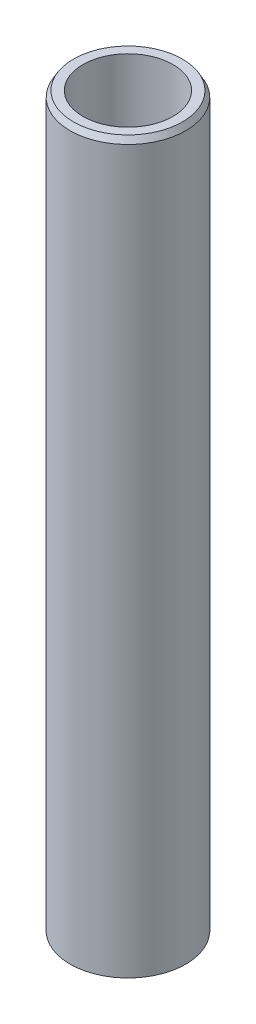
ISO-10303-21;
HEADER;
FILE_DESCRIPTION(('STEP AP214'),'2;1');
FILE_NAME('part.step','',(''),(''),'','','');
FILE_SCHEMA(('AUTOMOTIVE_DESIGN { 1 0 10303 214 1 1 1 1 }'));
ENDSEC;
DATA;
#1=APPLICATION_CONTEXT('core data for automotive mechanical design processes');
#2=APPLICATION_PROTOCOL_DEFINITION('international standard','automotive_design',2000,#1);
#3=PRODUCT_CONTEXT('',#1,'mechanical');
#4=PRODUCT('Part','Part','',(#3));
#5=PRODUCT_RELATED_PRODUCT_CATEGORY('part','',(#4));
#6=PRODUCT_DEFINITION_FORMATION('','',#4);
#7=PRODUCT_DEFINITION_CONTEXT('part definition',#1,'design');
#8=PRODUCT_DEFINITION('design','',#6,#7);
#9=PRODUCT_DEFINITION_SHAPE('','',#8);
#10=(LENGTH_UNIT() NAMED_UNIT(*) SI_UNIT(.MILLI.,.METRE.));
#11=(NAMED_UNIT(*) PLANE_ANGLE_UNIT() SI_UNIT($,.RADIAN.));
#12=(NAMED_UNIT(*) SI_UNIT($,.STERADIAN.) SOLID_ANGLE_UNIT());
#13=UNCERTAINTY_MEASURE_WITH_UNIT(LENGTH_MEASURE(1.E-05),#10,'distance_accuracy_value','');
#14=(GEOMETRIC_REPRESENTATION_CONTEXT(3) GLOBAL_UNCERTAINTY_ASSIGNED_CONTEXT((#13)) GLOBAL_UNIT_ASSIGNED_CONTEXT((#10,
#11,#12)) REPRESENTATION_CONTEXT('',''));
#15=CARTESIAN_POINT('',(0.,0.,0.));
#16=DIRECTION('',(0.,0.,1.));
#17=DIRECTION('',(1.,0.,0.));
#18=AXIS2_PLACEMENT_3D('',#15,#16,#17);
#19=CARTESIAN_POINT('',(0.,600.,0.));
#20=DIRECTION('',(0.,-1.,0.));
#21=DIRECTION('',(0.,0.,-1.));
#22=AXIS2_PLACEMENT_3D('',#19,#20,#21);
#23=CYLINDRICAL_SURFACE('',#22,47.5);
#24=CARTESIAN_POINT('',(0.,595.170322937131,0.));
#25=DIRECTION('',(0.,1.,0.));
#26=DIRECTION('',(0.,0.,1.));
#27=AXIS2_PLACEMENT_3D('',#24,#25,#26);
#28=CIRCLE('',#27,47.5);
#29=CARTESIAN_POINT('',(0.,595.170322937131,47.5));
#30=VERTEX_POINT('',#29);
#31=EDGE_CURVE('E50',#30,#30,#28,.F.);
#32=ORIENTED_EDGE('',*,*,#31,.T.);
#33=EDGE_LOOP('',(#32));
#34=FACE_BOUND('',#33,.T.);
#35=CARTESIAN_POINT('',(0.,2.7884153523462,0.));
#36=DIRECTION('',(0.,1.,0.));
#37=DIRECTION('',(0.,0.,1.));
#38=AXIS2_PLACEMENT_3D('',#35,#36,#37);
#39=CIRCLE('',#38,47.5);
#40=CARTESIAN_POINT('',(0.,2.7884153523462,47.5));
#41=VERTEX_POINT('',#40);
#42=EDGE_CURVE('E51',#41,#41,#39,.T.);
#43=ORIENTED_EDGE('',*,*,#42,.T.);
#44=EDGE_LOOP('',(#43));
#45=FACE_BOUND('',#44,.T.);
#46=ADVANCED_FACE('F39',(#34,#45),#23,.T.);
#47=CARTESIAN_POINT('',(0.,600.,0.));
#48=DIRECTION('',(0.,1.,0.));
#49=DIRECTION('',(0.,0.,1.));
#50=AXIS2_PLACEMENT_3D('',#47,#48,#49);
#51=PLANE('',#50);
#52=CARTESIAN_POINT('',(0.,600.,0.));
#53=DIRECTION('',(0.,1.,0.));
#54=DIRECTION('',(0.,0.,1.));
#55=AXIS2_PLACEMENT_3D('',#52,#53,#54);
#56=CIRCLE('',#55,44.7115846476539);
#57=CARTESIAN_POINT('',(0.,600.,44.7115846476539));
#58=VERTEX_POINT('',#57);
#59=EDGE_CURVE('E54',#58,#58,#56,.T.);
#60=ORIENTED_EDGE('',*,*,#59,.T.);
#61=EDGE_LOOP('',(#60));
#62=FACE_BOUND('',#61,.T.);
#63=CARTESIAN_POINT('',(0.,600.,0.));
#64=DIRECTION('',(0.,1.,0.));
#65=DIRECTION('',(0.,0.,1.));
#66=AXIS2_PLACEMENT_3D('',#63,#64,#65);
#67=CIRCLE('',#66,36.9378189526042);
#68=CARTESIAN_POINT('',(0.,600.,36.9378189526042));
#69=VERTEX_POINT('',#68);
#70=EDGE_CURVE('E58',#69,#69,#67,.T.);
#71=ORIENTED_EDGE('',*,*,#70,.F.);
#72=EDGE_LOOP('',(#71));
#73=FACE_BOUND('',#72,.T.);
#74=ADVANCED_FACE('F69',(#62,#73),#51,.T.);
#75=CARTESIAN_POINT('',(0.,0.,0.));
#76=DIRECTION('',(0.,1.,0.));
#77=DIRECTION('',(0.,0.,1.));
#78=AXIS2_PLACEMENT_3D('',#75,#76,#77);
#79=PLANE('',#78);
#80=CARTESIAN_POINT('',(0.,0.,0.));
#81=DIRECTION('',(0.,1.,0.));
#82=DIRECTION('',(0.,0.,1.));
#83=AXIS2_PLACEMENT_3D('',#80,#81,#82);
#84=CIRCLE('',#83,42.6703229371314);
#85=CARTESIAN_POINT('',(0.,0.,42.6703229371314));
#86=VERTEX_POINT('',#85);
#87=EDGE_CURVE('E10',#86,#86,#84,.F.);
#88=ORIENTED_EDGE('',*,*,#87,.T.);
#89=EDGE_LOOP('',(#88));
#90=FACE_BOUND('',#89,.T.);
#91=CARTESIAN_POINT('',(0.,0.,0.));
#92=DIRECTION('',(0.,1.,0.));
#93=DIRECTION('',(0.,0.,1.));
#94=AXIS2_PLACEMENT_3D('',#91,#92,#93);
#95=CIRCLE('',#94,36.9378189526042);
#96=CARTESIAN_POINT('',(0.,0.,36.9378189526042));
#97=VERTEX_POINT('',#96);
#98=EDGE_CURVE('E63',#97,#97,#95,.T.);
#99=ORIENTED_EDGE('',*,*,#98,.T.);
#100=EDGE_LOOP('',(#99));
#101=FACE_BOUND('',#100,.T.);
#102=ADVANCED_FACE('F75',(#90,#101),#79,.F.);
#103=CARTESIAN_POINT('',(0.,600.,0.));
#104=DIRECTION('',(0.,-1.,0.));
#105=DIRECTION('',(0.,0.,-1.));
#106=AXIS2_PLACEMENT_3D('',#103,#104,#105);
#107=CYLINDRICAL_SURFACE('',#106,36.9378189526042);
#108=ORIENTED_EDGE('',*,*,#70,.T.);
#109=EDGE_LOOP('',(#108));
#110=FACE_BOUND('',#109,.T.);
#111=ORIENTED_EDGE('',*,*,#98,.F.);
#112=EDGE_LOOP('',(#111));
#113=FACE_BOUND('',#112,.T.);
#114=ADVANCED_FACE('F70',(#110,#113),#107,.F.);
#115=CARTESIAN_POINT('',(0.,600.,0.));
#116=DIRECTION('',(0.,-1.,0.));
#117=DIRECTION('',(0.,0.,-1.));
#118=AXIS2_PLACEMENT_3D('',#115,#116,#117);
#119=CONICAL_SURFACE('',#118,44.7115846476539,0.52359877559829);
#120=ORIENTED_EDGE('',*,*,#31,.F.);
#121=EDGE_LOOP('',(#120));
#122=FACE_BOUND('',#121,.T.);
#123=ORIENTED_EDGE('',*,*,#59,.F.);
#124=EDGE_LOOP('',(#123));
#125=FACE_BOUND('',#124,.T.);
#126=ADVANCED_FACE('F81',(#122,#125),#119,.T.);
#127=CARTESIAN_POINT('',(0.,2.7884153523462,0.));
#128=DIRECTION('',(0.,1.,0.));
#129=DIRECTION('',(0.,0.,1.));
#130=AXIS2_PLACEMENT_3D('',#127,#128,#129);
#131=CONICAL_SURFACE('',#130,47.5,1.04719755119659);
#132=ORIENTED_EDGE('',*,*,#87,.F.);
#133=EDGE_LOOP('',(#132));
#134=FACE_BOUND('',#133,.T.);
#135=ORIENTED_EDGE('',*,*,#42,.F.);
#136=EDGE_LOOP('',(#135));
#137=FACE_BOUND('',#136,.T.);
#138=ADVANCED_FACE('F45',(#134,#137),#131,.T.);
#139=CLOSED_SHELL('',(#46,#74,#102,#114,#126,#138));
#140=MANIFOLD_SOLID_BREP('B2',#139);
#141=ADVANCED_BREP_SHAPE_REPRESENTATION('',(#18,#140),#14);
#142=SHAPE_DEFINITION_REPRESENTATION(#9,#141);
ENDSEC;
END-ISO-10303-21;
